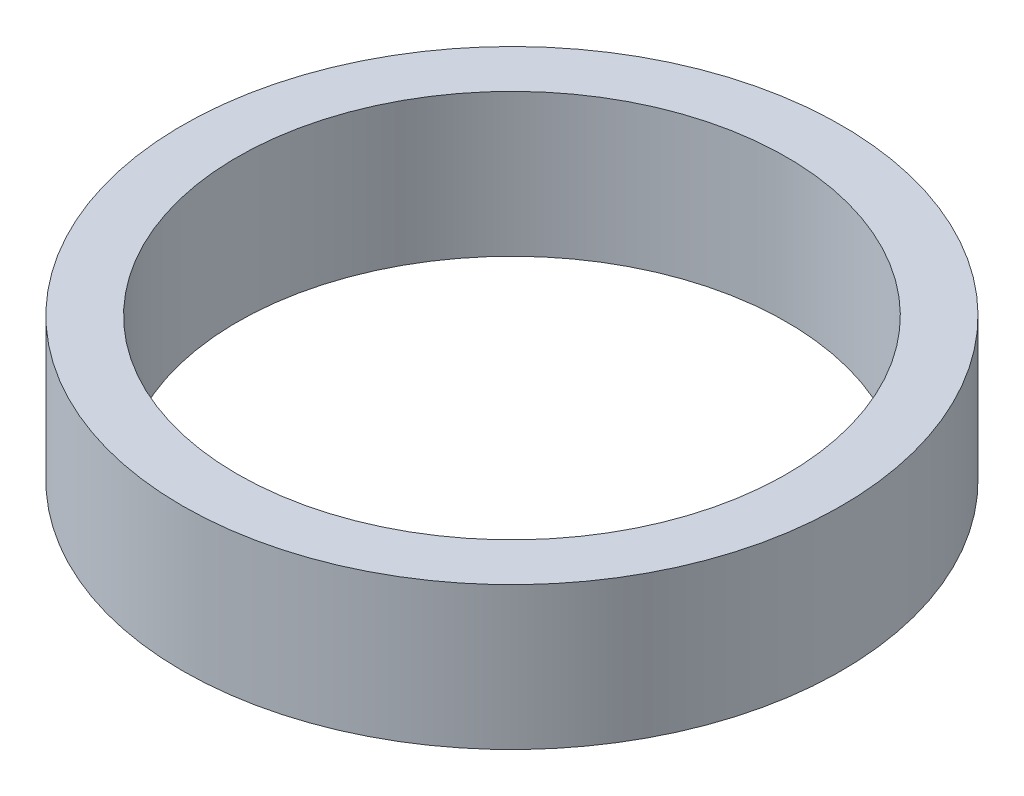
ISO-10303-21;
HEADER;
FILE_DESCRIPTION(('STEP AP214'),'2;1');
FILE_NAME('part.step','',(''),(''),'','','');
FILE_SCHEMA(('AUTOMOTIVE_DESIGN { 1 0 10303 214 1 1 1 1 }'));
ENDSEC;
DATA;
#1=APPLICATION_CONTEXT('core data for automotive mechanical design processes');
#2=APPLICATION_PROTOCOL_DEFINITION('international standard','automotive_design',2000,#1);
#3=PRODUCT_CONTEXT('',#1,'mechanical');
#4=PRODUCT('Part','Part','',(#3));
#5=PRODUCT_RELATED_PRODUCT_CATEGORY('part','',(#4));
#6=PRODUCT_DEFINITION_FORMATION('','',#4);
#7=PRODUCT_DEFINITION_CONTEXT('part definition',#1,'design');
#8=PRODUCT_DEFINITION('design','',#6,#7);
#9=PRODUCT_DEFINITION_SHAPE('','',#8);
#10=(LENGTH_UNIT() NAMED_UNIT(*) SI_UNIT(.MILLI.,.METRE.));
#11=(NAMED_UNIT(*) PLANE_ANGLE_UNIT() SI_UNIT($,.RADIAN.));
#12=(NAMED_UNIT(*) SI_UNIT($,.STERADIAN.) SOLID_ANGLE_UNIT());
#13=UNCERTAINTY_MEASURE_WITH_UNIT(LENGTH_MEASURE(1.E-05),#10,'distance_accuracy_value','');
#14=(GEOMETRIC_REPRESENTATION_CONTEXT(3) GLOBAL_UNCERTAINTY_ASSIGNED_CONTEXT((#13)) GLOBAL_UNIT_ASSIGNED_CONTEXT((#10,
#11,#12)) REPRESENTATION_CONTEXT('',''));
#15=CARTESIAN_POINT('',(0.,0.,0.));
#16=DIRECTION('',(0.,0.,1.));
#17=DIRECTION('',(1.,0.,0.));
#18=AXIS2_PLACEMENT_3D('',#15,#16,#17);
#19=CARTESIAN_POINT('',(0.,6.5,0.));
#20=DIRECTION('',(0.,1.,0.));
#21=DIRECTION('',(0.,0.,1.));
#22=AXIS2_PLACEMENT_3D('',#19,#20,#21);
#23=PLANE('',#22);
#24=CARTESIAN_POINT('',(0.,6.5,0.));
#25=DIRECTION('',(0.,1.,0.));
#26=DIRECTION('',(0.,0.,1.));
#27=AXIS2_PLACEMENT_3D('',#24,#25,#26);
#28=CIRCLE('',#27,30.);
#29=CARTESIAN_POINT('',(0.,6.5,30.));
#30=VERTEX_POINT('',#29);
#31=EDGE_CURVE('E10',#30,#30,#28,.T.);
#32=ORIENTED_EDGE('',*,*,#31,.T.);
#33=EDGE_LOOP('',(#32));
#34=FACE_BOUND('',#33,.T.);
#35=CARTESIAN_POINT('',(0.,6.5,0.));
#36=DIRECTION('',(0.,1.,0.));
#37=DIRECTION('',(0.,0.,1.));
#38=AXIS2_PLACEMENT_3D('',#35,#36,#37);
#39=CIRCLE('',#38,25.);
#40=CARTESIAN_POINT('',(0.,6.5,25.));
#41=VERTEX_POINT('',#40);
#42=EDGE_CURVE('E44',#41,#41,#39,.T.);
#43=ORIENTED_EDGE('',*,*,#42,.F.);
#44=EDGE_LOOP('',(#43));
#45=FACE_BOUND('',#44,.T.);
#46=ADVANCED_FACE('F33',(#34,#45),#23,.T.);
#47=CARTESIAN_POINT('',(0.,-6.5,0.));
#48=DIRECTION('',(0.,1.,0.));
#49=DIRECTION('',(0.,0.,1.));
#50=AXIS2_PLACEMENT_3D('',#47,#48,#49);
#51=PLANE('',#50);
#52=CARTESIAN_POINT('',(0.,-6.5,0.));
#53=DIRECTION('',(0.,1.,0.));
#54=DIRECTION('',(0.,0.,1.));
#55=AXIS2_PLACEMENT_3D('',#52,#53,#54);
#56=CIRCLE('',#55,30.);
#57=CARTESIAN_POINT('',(0.,-6.5,30.));
#58=VERTEX_POINT('',#57);
#59=EDGE_CURVE('E37',#58,#58,#56,.T.);
#60=ORIENTED_EDGE('',*,*,#59,.F.);
#61=EDGE_LOOP('',(#60));
#62=FACE_BOUND('',#61,.T.);
#63=CARTESIAN_POINT('',(0.,-6.5,0.));
#64=DIRECTION('',(0.,1.,0.));
#65=DIRECTION('',(0.,0.,1.));
#66=AXIS2_PLACEMENT_3D('',#63,#64,#65);
#67=CIRCLE('',#66,25.);
#68=CARTESIAN_POINT('',(0.,-6.5,25.));
#69=VERTEX_POINT('',#68);
#70=EDGE_CURVE('E46',#69,#69,#67,.T.);
#71=ORIENTED_EDGE('',*,*,#70,.T.);
#72=EDGE_LOOP('',(#71));
#73=FACE_BOUND('',#72,.T.);
#74=ADVANCED_FACE('F56',(#62,#73),#51,.F.);
#75=CARTESIAN_POINT('',(0.,6.5,0.));
#76=DIRECTION('',(0.,-1.,0.));
#77=DIRECTION('',(0.,0.,-1.));
#78=AXIS2_PLACEMENT_3D('',#75,#76,#77);
#79=CYLINDRICAL_SURFACE('',#78,30.);
#80=ORIENTED_EDGE('',*,*,#31,.F.);
#81=EDGE_LOOP('',(#80));
#82=FACE_BOUND('',#81,.T.);
#83=ORIENTED_EDGE('',*,*,#59,.T.);
#84=EDGE_LOOP('',(#83));
#85=FACE_BOUND('',#84,.T.);
#86=ADVANCED_FACE('F35',(#82,#85),#79,.T.);
#87=CARTESIAN_POINT('',(0.,6.5,0.));
#88=DIRECTION('',(0.,-1.,0.));
#89=DIRECTION('',(0.,0.,-1.));
#90=AXIS2_PLACEMENT_3D('',#87,#88,#89);
#91=CYLINDRICAL_SURFACE('',#90,25.);
#92=ORIENTED_EDGE('',*,*,#42,.T.);
#93=EDGE_LOOP('',(#92));
#94=FACE_BOUND('',#93,.T.);
#95=ORIENTED_EDGE('',*,*,#70,.F.);
#96=EDGE_LOOP('',(#95));
#97=FACE_BOUND('',#96,.T.);
#98=ADVANCED_FACE('F52',(#94,#97),#91,.F.);
#99=CLOSED_SHELL('',(#46,#74,#86,#98));
#100=MANIFOLD_SOLID_BREP('B2',#99);
#101=ADVANCED_BREP_SHAPE_REPRESENTATION('',(#18,#100),#14);
#102=SHAPE_DEFINITION_REPRESENTATION(#9,#101);
ENDSEC;
END-ISO-10303-21;
